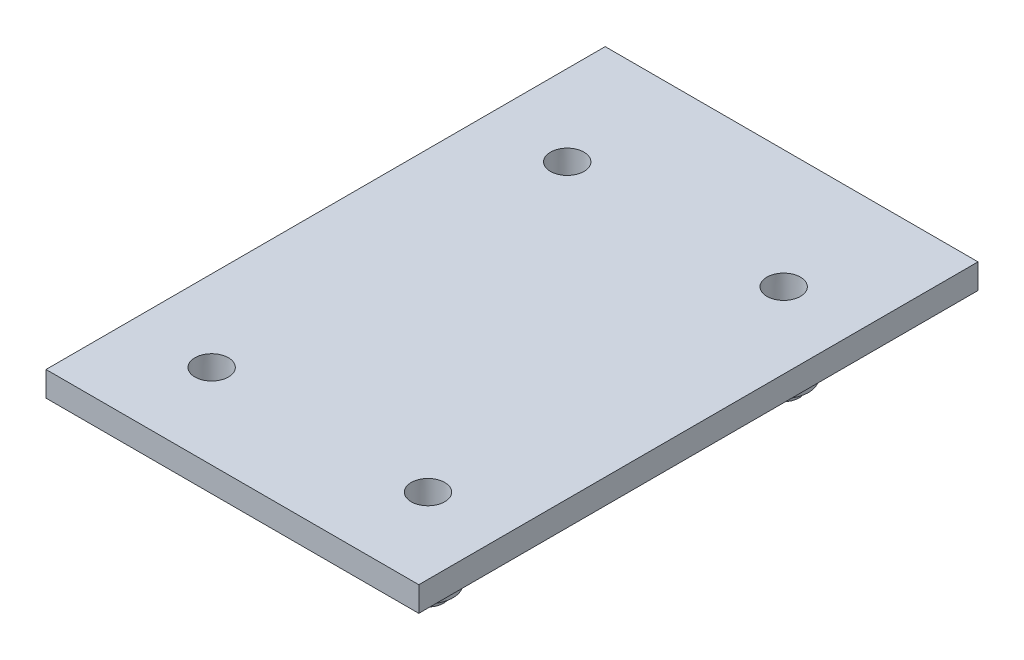
ISO-10303-21;
HEADER;
FILE_DESCRIPTION(('STEP AP214'),'2;1');
FILE_NAME('part.step','',(''),(''),'','','');
FILE_SCHEMA(('AUTOMOTIVE_DESIGN { 1 0 10303 214 1 1 1 1 }'));
ENDSEC;
DATA;
#1=APPLICATION_CONTEXT('core data for automotive mechanical design processes');
#2=APPLICATION_PROTOCOL_DEFINITION('international standard','automotive_design',2000,#1);
#3=PRODUCT_CONTEXT('',#1,'mechanical');
#4=PRODUCT('Part','Part','',(#3));
#5=PRODUCT_RELATED_PRODUCT_CATEGORY('part','',(#4));
#6=PRODUCT_DEFINITION_FORMATION('','',#4);
#7=PRODUCT_DEFINITION_CONTEXT('part definition',#1,'design');
#8=PRODUCT_DEFINITION('design','',#6,#7);
#9=PRODUCT_DEFINITION_SHAPE('','',#8);
#10=(LENGTH_UNIT() NAMED_UNIT(*) SI_UNIT(.MILLI.,.METRE.));
#11=(NAMED_UNIT(*) PLANE_ANGLE_UNIT() SI_UNIT($,.RADIAN.));
#12=(NAMED_UNIT(*) SI_UNIT($,.STERADIAN.) SOLID_ANGLE_UNIT());
#13=UNCERTAINTY_MEASURE_WITH_UNIT(LENGTH_MEASURE(1.E-05),#10,'distance_accuracy_value','');
#14=(GEOMETRIC_REPRESENTATION_CONTEXT(3) GLOBAL_UNCERTAINTY_ASSIGNED_CONTEXT((#13)) GLOBAL_UNIT_ASSIGNED_CONTEXT((#10,
#11,#12)) REPRESENTATION_CONTEXT('',''));
#15=CARTESIAN_POINT('',(0.,0.,0.));
#16=DIRECTION('',(0.,0.,1.));
#17=DIRECTION('',(1.,0.,0.));
#18=AXIS2_PLACEMENT_3D('',#15,#16,#17);
#19=CARTESIAN_POINT('',(30.,4.,45.));
#20=DIRECTION('',(-1.,0.,0.));
#21=DIRECTION('',(0.,0.,1.));
#22=AXIS2_PLACEMENT_3D('',#19,#20,#21);
#23=PLANE('',#22);
#24=DIRECTION('',(0.,0.,-1.));
#25=VECTOR('',#24,1.);
#26=CARTESIAN_POINT('',(30.,0.,45.));
#27=LINE('',#26,#25);
#28=CARTESIAN_POINT('',(30.,0.,45.));
#29=VERTEX_POINT('',#28);
#30=CARTESIAN_POINT('',(30.,0.,-45.));
#31=VERTEX_POINT('',#30);
#32=EDGE_CURVE('E130',#29,#31,#27,.T.);
#33=ORIENTED_EDGE('',*,*,#32,.T.);
#34=DIRECTION('',(0.,-1.,0.));
#35=VECTOR('',#34,1.);
#36=CARTESIAN_POINT('',(30.,4.,-45.));
#37=LINE('',#36,#35);
#38=CARTESIAN_POINT('',(30.,4.,-45.));
#39=VERTEX_POINT('',#38);
#40=EDGE_CURVE('E12',#39,#31,#37,.T.);
#41=ORIENTED_EDGE('',*,*,#40,.F.);
#42=DIRECTION('',(0.,0.,-1.));
#43=VECTOR('',#42,1.);
#44=CARTESIAN_POINT('',(30.,4.,45.));
#45=LINE('',#44,#43);
#46=CARTESIAN_POINT('',(30.,4.,45.));
#47=VERTEX_POINT('',#46);
#48=EDGE_CURVE('E140',#47,#39,#45,.T.);
#49=ORIENTED_EDGE('',*,*,#48,.F.);
#50=DIRECTION('',(0.,-1.,0.));
#51=VECTOR('',#50,1.);
#52=CARTESIAN_POINT('',(30.,4.,45.));
#53=LINE('',#52,#51);
#54=EDGE_CURVE('E149',#47,#29,#53,.T.);
#55=ORIENTED_EDGE('',*,*,#54,.T.);
#56=EDGE_LOOP('',(#33,#41,#49,#55));
#57=FACE_BOUND('',#56,.T.);
#58=ADVANCED_FACE('F44',(#57),#23,.F.);
#59=CARTESIAN_POINT('',(-30.,4.,-45.));
#60=DIRECTION('',(0.,0.,1.));
#61=DIRECTION('',(1.,0.,0.));
#62=AXIS2_PLACEMENT_3D('',#59,#60,#61);
#63=PLANE('',#62);
#64=DIRECTION('',(-1.,0.,0.));
#65=VECTOR('',#64,1.);
#66=CARTESIAN_POINT('',(-30.,0.,-45.));
#67=LINE('',#66,#65);
#68=CARTESIAN_POINT('',(-30.,0.,-45.));
#69=VERTEX_POINT('',#68);
#70=EDGE_CURVE('E132',#31,#69,#67,.T.);
#71=ORIENTED_EDGE('',*,*,#70,.T.);
#72=DIRECTION('',(0.,-1.,0.));
#73=VECTOR('',#72,1.);
#74=CARTESIAN_POINT('',(-30.,4.,-45.));
#75=LINE('',#74,#73);
#76=CARTESIAN_POINT('',(-30.,4.,-45.));
#77=VERTEX_POINT('',#76);
#78=EDGE_CURVE('E52',#77,#69,#75,.T.);
#79=ORIENTED_EDGE('',*,*,#78,.F.);
#80=DIRECTION('',(-1.,0.,0.));
#81=VECTOR('',#80,1.);
#82=CARTESIAN_POINT('',(-30.,4.,-45.));
#83=LINE('',#82,#81);
#84=EDGE_CURVE('E143',#39,#77,#83,.T.);
#85=ORIENTED_EDGE('',*,*,#84,.F.);
#86=ORIENTED_EDGE('',*,*,#40,.T.);
#87=EDGE_LOOP('',(#71,#79,#85,#86));
#88=FACE_BOUND('',#87,.T.);
#89=ADVANCED_FACE('F277',(#88),#63,.F.);
#90=CARTESIAN_POINT('',(-30.,4.,45.));
#91=DIRECTION('',(1.,0.,0.));
#92=DIRECTION('',(0.,0.,-1.));
#93=AXIS2_PLACEMENT_3D('',#90,#91,#92);
#94=PLANE('',#93);
#95=DIRECTION('',(0.,0.,1.));
#96=VECTOR('',#95,1.);
#97=CARTESIAN_POINT('',(-30.,0.,45.));
#98=LINE('',#97,#96);
#99=CARTESIAN_POINT('',(-30.,0.,45.));
#100=VERTEX_POINT('',#99);
#101=EDGE_CURVE('E152',#69,#100,#98,.T.);
#102=ORIENTED_EDGE('',*,*,#101,.T.);
#103=DIRECTION('',(0.,-1.,0.));
#104=VECTOR('',#103,1.);
#105=CARTESIAN_POINT('',(-30.,4.,45.));
#106=LINE('',#105,#104);
#107=CARTESIAN_POINT('',(-30.,4.,45.));
#108=VERTEX_POINT('',#107);
#109=EDGE_CURVE('E157',#108,#100,#106,.T.);
#110=ORIENTED_EDGE('',*,*,#109,.F.);
#111=DIRECTION('',(0.,0.,1.));
#112=VECTOR('',#111,1.);
#113=CARTESIAN_POINT('',(-30.,4.,45.));
#114=LINE('',#113,#112);
#115=EDGE_CURVE('E146',#77,#108,#114,.T.);
#116=ORIENTED_EDGE('',*,*,#115,.F.);
#117=ORIENTED_EDGE('',*,*,#78,.T.);
#118=EDGE_LOOP('',(#102,#110,#116,#117));
#119=FACE_BOUND('',#118,.T.);
#120=ADVANCED_FACE('F282',(#119),#94,.F.);
#121=CARTESIAN_POINT('',(-30.,4.,45.));
#122=DIRECTION('',(0.,0.,-1.));
#123=DIRECTION('',(-1.,0.,0.));
#124=AXIS2_PLACEMENT_3D('',#121,#122,#123);
#125=PLANE('',#124);
#126=DIRECTION('',(1.,0.,0.));
#127=VECTOR('',#126,1.);
#128=CARTESIAN_POINT('',(-30.,0.,45.));
#129=LINE('',#128,#127);
#130=EDGE_CURVE('E144',#100,#29,#129,.T.);
#131=ORIENTED_EDGE('',*,*,#130,.T.);
#132=ORIENTED_EDGE('',*,*,#54,.F.);
#133=DIRECTION('',(1.,0.,0.));
#134=VECTOR('',#133,1.);
#135=CARTESIAN_POINT('',(-30.,4.,45.));
#136=LINE('',#135,#134);
#137=EDGE_CURVE('E148',#108,#47,#136,.T.);
#138=ORIENTED_EDGE('',*,*,#137,.F.);
#139=ORIENTED_EDGE('',*,*,#109,.T.);
#140=EDGE_LOOP('',(#131,#132,#138,#139));
#141=FACE_BOUND('',#140,.T.);
#142=ADVANCED_FACE('F299',(#141),#125,.F.);
#143=CARTESIAN_POINT('',(0.,4.,0.));
#144=DIRECTION('',(0.,-1.,0.));
#145=DIRECTION('',(0.,0.,-1.));
#146=AXIS2_PLACEMENT_3D('',#143,#144,#145);
#147=PLANE('',#146);
#148=CARTESIAN_POINT('',(-17.0018387869124,4.,-25.8889221723884));
#149=DIRECTION('',(0.,-1.,0.));
#150=DIRECTION('',(0.,0.,-1.));
#151=AXIS2_PLACEMENT_3D('',#148,#149,#150);
#152=CIRCLE('',#151,2.69629966018273);
#153=CARTESIAN_POINT('',(-17.0018387869124,4.,-28.5852218325711));
#154=VERTEX_POINT('',#153);
#155=EDGE_CURVE('E47',#154,#154,#152,.T.);
#156=ORIENTED_EDGE('',*,*,#155,.T.);
#157=EDGE_LOOP('',(#156));
#158=FACE_BOUND('',#157,.T.);
#159=CARTESIAN_POINT('',(17.8349114378147,4.,-25.8889221723884));
#160=DIRECTION('',(0.,-1.,0.));
#161=DIRECTION('',(0.,0.,-1.));
#162=AXIS2_PLACEMENT_3D('',#159,#160,#161);
#163=CIRCLE('',#162,2.69629966018273);
#164=CARTESIAN_POINT('',(17.8349114378147,4.,-28.5852218325711));
#165=VERTEX_POINT('',#164);
#166=EDGE_CURVE('E171',#165,#165,#163,.T.);
#167=ORIENTED_EDGE('',*,*,#166,.T.);
#168=EDGE_LOOP('',(#167));
#169=FACE_BOUND('',#168,.T.);
#170=CARTESIAN_POINT('',(17.8349114378147,4.,31.3583092049967));
#171=DIRECTION('',(0.,-1.,0.));
#172=DIRECTION('',(0.,0.,-1.));
#173=AXIS2_PLACEMENT_3D('',#170,#171,#172);
#174=CIRCLE('',#173,2.69629966018273);
#175=CARTESIAN_POINT('',(17.8349114378147,4.,28.662009544814));
#176=VERTEX_POINT('',#175);
#177=EDGE_CURVE('E167',#176,#176,#174,.T.);
#178=ORIENTED_EDGE('',*,*,#177,.T.);
#179=EDGE_LOOP('',(#178));
#180=FACE_BOUND('',#179,.T.);
#181=CARTESIAN_POINT('',(-16.9575770469292,4.,31.3777064335516));
#182=DIRECTION('',(0.,-1.,0.));
#183=DIRECTION('',(0.,0.,-1.));
#184=AXIS2_PLACEMENT_3D('',#181,#182,#183);
#185=CIRCLE('',#184,2.69629966018273);
#186=CARTESIAN_POINT('',(-16.9575770469292,4.,28.6814067733688));
#187=VERTEX_POINT('',#186);
#188=EDGE_CURVE('E162',#187,#187,#185,.T.);
#189=ORIENTED_EDGE('',*,*,#188,.T.);
#190=EDGE_LOOP('',(#189));
#191=FACE_BOUND('',#190,.T.);
#192=ORIENTED_EDGE('',*,*,#48,.T.);
#193=ORIENTED_EDGE('',*,*,#84,.T.);
#194=ORIENTED_EDGE('',*,*,#115,.T.);
#195=ORIENTED_EDGE('',*,*,#137,.T.);
#196=EDGE_LOOP('',(#192,#193,#194,#195));
#197=FACE_BOUND('',#196,.T.);
#198=ADVANCED_FACE('F295',(#158,#169,#180,#191,#197),#147,.F.);
#199=CARTESIAN_POINT('',(0.,0.,0.));
#200=DIRECTION('',(0.,-1.,0.));
#201=DIRECTION('',(0.,0.,-1.));
#202=AXIS2_PLACEMENT_3D('',#199,#200,#201);
#203=PLANE('',#202);
#204=DIRECTION('',(0.,0.,1.));
#205=VECTOR('',#204,1.);
#206=CARTESIAN_POINT('',(27.,0.,-42.));
#207=LINE('',#206,#205);
#208=CARTESIAN_POINT('',(27.,0.,-42.));
#209=VERTEX_POINT('',#208);
#210=CARTESIAN_POINT('',(27.,0.,42.));
#211=VERTEX_POINT('',#210);
#212=EDGE_CURVE('E60',#209,#211,#207,.T.);
#213=ORIENTED_EDGE('',*,*,#212,.F.);
#214=DIRECTION('',(1.,0.,0.));
#215=VECTOR('',#214,1.);
#216=CARTESIAN_POINT('',(-27.,0.,-42.));
#217=LINE('',#216,#215);
#218=CARTESIAN_POINT('',(-27.,0.,-42.));
#219=VERTEX_POINT('',#218);
#220=EDGE_CURVE('E64',#219,#209,#217,.T.);
#221=ORIENTED_EDGE('',*,*,#220,.F.);
#222=DIRECTION('',(0.,0.,-1.));
#223=VECTOR('',#222,1.);
#224=CARTESIAN_POINT('',(-27.,0.,-42.));
#225=LINE('',#224,#223);
#226=CARTESIAN_POINT('',(-27.,0.,42.));
#227=VERTEX_POINT('',#226);
#228=EDGE_CURVE('E252',#227,#219,#225,.T.);
#229=ORIENTED_EDGE('',*,*,#228,.F.);
#230=DIRECTION('',(-1.,0.,0.));
#231=VECTOR('',#230,1.);
#232=CARTESIAN_POINT('',(-27.,0.,42.));
#233=LINE('',#232,#231);
#234=EDGE_CURVE('E249',#211,#227,#233,.T.);
#235=ORIENTED_EDGE('',*,*,#234,.F.);
#236=EDGE_LOOP('',(#213,#221,#229,#235));
#237=FACE_BOUND('',#236,.T.);
#238=ORIENTED_EDGE('',*,*,#32,.F.);
#239=ORIENTED_EDGE('',*,*,#130,.F.);
#240=ORIENTED_EDGE('',*,*,#101,.F.);
#241=ORIENTED_EDGE('',*,*,#70,.F.);
#242=EDGE_LOOP('',(#238,#239,#240,#241));
#243=FACE_BOUND('',#242,.T.);
#244=ADVANCED_FACE('F290',(#237,#243),#203,.T.);
#245=CARTESIAN_POINT('',(27.,-3.,-42.));
#246=DIRECTION('',(-1.,0.,0.));
#247=DIRECTION('',(0.,0.,1.));
#248=AXIS2_PLACEMENT_3D('',#245,#246,#247);
#249=PLANE('',#248);
#250=ORIENTED_EDGE('',*,*,#212,.T.);
#251=DIRECTION('',(0.,1.,0.));
#252=VECTOR('',#251,1.);
#253=CARTESIAN_POINT('',(27.,-3.,42.));
#254=LINE('',#253,#252);
#255=CARTESIAN_POINT('',(27.,-3.,42.));
#256=VERTEX_POINT('',#255);
#257=EDGE_CURVE('E113',#256,#211,#254,.T.);
#258=ORIENTED_EDGE('',*,*,#257,.F.);
#259=DIRECTION('',(0.,0.,1.));
#260=VECTOR('',#259,1.);
#261=CARTESIAN_POINT('',(27.,-3.,-42.));
#262=LINE('',#261,#260);
#263=CARTESIAN_POINT('',(27.,-3.,-42.));
#264=VERTEX_POINT('',#263);
#265=EDGE_CURVE('E119',#264,#256,#262,.T.);
#266=ORIENTED_EDGE('',*,*,#265,.F.);
#267=DIRECTION('',(0.,1.,0.));
#268=VECTOR('',#267,1.);
#269=CARTESIAN_POINT('',(27.,-3.,-42.));
#270=LINE('',#269,#268);
#271=EDGE_CURVE('E247',#264,#209,#270,.T.);
#272=ORIENTED_EDGE('',*,*,#271,.T.);
#273=EDGE_LOOP('',(#250,#258,#266,#272));
#274=FACE_BOUND('',#273,.T.);
#275=ADVANCED_FACE('F129',(#274),#249,.F.);
#276=CARTESIAN_POINT('',(-27.,-3.,42.));
#277=DIRECTION('',(0.,0.,-1.));
#278=DIRECTION('',(-1.,0.,0.));
#279=AXIS2_PLACEMENT_3D('',#276,#277,#278);
#280=PLANE('',#279);
#281=ORIENTED_EDGE('',*,*,#234,.T.);
#282=DIRECTION('',(0.,1.,0.));
#283=VECTOR('',#282,1.);
#284=CARTESIAN_POINT('',(-27.,-3.,42.));
#285=LINE('',#284,#283);
#286=CARTESIAN_POINT('',(-27.,-3.,42.));
#287=VERTEX_POINT('',#286);
#288=EDGE_CURVE('E115',#287,#227,#285,.T.);
#289=ORIENTED_EDGE('',*,*,#288,.F.);
#290=DIRECTION('',(-1.,0.,0.));
#291=VECTOR('',#290,1.);
#292=CARTESIAN_POINT('',(-27.,-3.,42.));
#293=LINE('',#292,#291);
#294=EDGE_CURVE('E108',#256,#287,#293,.T.);
#295=ORIENTED_EDGE('',*,*,#294,.F.);
#296=ORIENTED_EDGE('',*,*,#257,.T.);
#297=EDGE_LOOP('',(#281,#289,#295,#296));
#298=FACE_BOUND('',#297,.T.);
#299=ADVANCED_FACE('F111',(#298),#280,.F.);
#300=CARTESIAN_POINT('',(-27.,-3.,-42.));
#301=DIRECTION('',(1.,0.,0.));
#302=DIRECTION('',(0.,0.,-1.));
#303=AXIS2_PLACEMENT_3D('',#300,#301,#302);
#304=PLANE('',#303);
#305=ORIENTED_EDGE('',*,*,#228,.T.);
#306=DIRECTION('',(0.,1.,0.));
#307=VECTOR('',#306,1.);
#308=CARTESIAN_POINT('',(-27.,-3.,-42.));
#309=LINE('',#308,#307);
#310=CARTESIAN_POINT('',(-27.,-3.,-42.));
#311=VERTEX_POINT('',#310);
#312=EDGE_CURVE('E134',#311,#219,#309,.T.);
#313=ORIENTED_EDGE('',*,*,#312,.F.);
#314=DIRECTION('',(0.,0.,-1.));
#315=VECTOR('',#314,1.);
#316=CARTESIAN_POINT('',(-27.,-3.,-42.));
#317=LINE('',#316,#315);
#318=EDGE_CURVE('E118',#287,#311,#317,.T.);
#319=ORIENTED_EDGE('',*,*,#318,.F.);
#320=ORIENTED_EDGE('',*,*,#288,.T.);
#321=EDGE_LOOP('',(#305,#313,#319,#320));
#322=FACE_BOUND('',#321,.T.);
#323=ADVANCED_FACE('F263',(#322),#304,.F.);
#324=CARTESIAN_POINT('',(-27.,-3.,-42.));
#325=DIRECTION('',(0.,0.,1.));
#326=DIRECTION('',(1.,0.,0.));
#327=AXIS2_PLACEMENT_3D('',#324,#325,#326);
#328=PLANE('',#327);
#329=ORIENTED_EDGE('',*,*,#220,.T.);
#330=ORIENTED_EDGE('',*,*,#271,.F.);
#331=DIRECTION('',(1.,0.,0.));
#332=VECTOR('',#331,1.);
#333=CARTESIAN_POINT('',(-27.,-3.,-42.));
#334=LINE('',#333,#332);
#335=EDGE_CURVE('E124',#311,#264,#334,.T.);
#336=ORIENTED_EDGE('',*,*,#335,.F.);
#337=ORIENTED_EDGE('',*,*,#312,.T.);
#338=EDGE_LOOP('',(#329,#330,#336,#337));
#339=FACE_BOUND('',#338,.T.);
#340=ADVANCED_FACE('F264',(#339),#328,.F.);
#341=CARTESIAN_POINT('',(0.,-3.,0.));
#342=DIRECTION('',(0.,1.,0.));
#343=DIRECTION('',(0.,0.,1.));
#344=AXIS2_PLACEMENT_3D('',#341,#342,#343);
#345=PLANE('',#344);
#346=CARTESIAN_POINT('',(-17.0018387869124,-3.,-25.8889221723884));
#347=DIRECTION('',(0.,1.,0.));
#348=DIRECTION('',(0.,0.,1.));
#349=AXIS2_PLACEMENT_3D('',#346,#347,#348);
#350=CIRCLE('',#349,4.20070541662467);
#351=CARTESIAN_POINT('',(-17.0018387869124,-3.,-21.6882167557637));
#352=VERTEX_POINT('',#351);
#353=EDGE_CURVE('E639',#352,#352,#350,.F.);
#354=ORIENTED_EDGE('',*,*,#353,.F.);
#355=EDGE_LOOP('',(#354));
#356=FACE_BOUND('',#355,.T.);
#357=CARTESIAN_POINT('',(17.8349114378147,-3.,-25.8889221723884));
#358=DIRECTION('',(0.,1.,0.));
#359=DIRECTION('',(0.,0.,1.));
#360=AXIS2_PLACEMENT_3D('',#357,#358,#359);
#361=CIRCLE('',#360,4.20070541662467);
#362=CARTESIAN_POINT('',(17.8349114378147,-3.,-21.6882167557637));
#363=VERTEX_POINT('',#362);
#364=EDGE_CURVE('E195',#363,#363,#361,.F.);
#365=ORIENTED_EDGE('',*,*,#364,.F.);
#366=EDGE_LOOP('',(#365));
#367=FACE_BOUND('',#366,.T.);
#368=CARTESIAN_POINT('',(17.8349114378147,-3.,31.3583092049967));
#369=DIRECTION('',(0.,1.,0.));
#370=DIRECTION('',(0.,0.,1.));
#371=AXIS2_PLACEMENT_3D('',#368,#369,#370);
#372=CIRCLE('',#371,4.20070541662467);
#373=CARTESIAN_POINT('',(17.8349114378147,-3.,35.5590146216214));
#374=VERTEX_POINT('',#373);
#375=EDGE_CURVE('E214',#374,#374,#372,.F.);
#376=ORIENTED_EDGE('',*,*,#375,.F.);
#377=EDGE_LOOP('',(#376));
#378=FACE_BOUND('',#377,.T.);
#379=CARTESIAN_POINT('',(-16.9575770469292,-3.,31.3777064335516));
#380=DIRECTION('',(0.,1.,0.));
#381=DIRECTION('',(0.,0.,1.));
#382=AXIS2_PLACEMENT_3D('',#379,#380,#381);
#383=CIRCLE('',#382,4.20070541662467);
#384=CARTESIAN_POINT('',(-16.9575770469292,-3.,35.5784118501762));
#385=VERTEX_POINT('',#384);
#386=EDGE_CURVE('E233',#385,#385,#383,.F.);
#387=ORIENTED_EDGE('',*,*,#386,.F.);
#388=EDGE_LOOP('',(#387));
#389=FACE_BOUND('',#388,.T.);
#390=ORIENTED_EDGE('',*,*,#265,.T.);
#391=ORIENTED_EDGE('',*,*,#294,.T.);
#392=ORIENTED_EDGE('',*,*,#318,.T.);
#393=ORIENTED_EDGE('',*,*,#335,.T.);
#394=EDGE_LOOP('',(#390,#391,#392,#393));
#395=FACE_BOUND('',#394,.T.);
#396=ADVANCED_FACE('F122',(#356,#367,#378,#389,#395),#345,.F.);
#397=CARTESIAN_POINT('',(-16.9575770469292,-8.74600000000003,31.3777064335516));
#398=DIRECTION('',(0.,1.,0.));
#399=DIRECTION('',(0.948683298050514,0.,-0.316227766016838));
#400=AXIS2_PLACEMENT_3D('',#397,#398,#399);
#401=CONICAL_SURFACE('',#400,4.,0.03491539349594);
#402=CARTESIAN_POINT('',(-16.9575770469292,-8.74600000000003,31.3777064335516));
#403=DIRECTION('',(0.,1.,0.));
#404=DIRECTION('',(0.948683298050514,0.,-0.316227766016838));
#405=AXIS2_PLACEMENT_3D('',#402,#403,#404);
#406=CIRCLE('',#405,4.);
#407=CARTESIAN_POINT('',(-13.1628438547272,-8.74600000000003,30.1127953694842));
#408=VERTEX_POINT('',#407);
#409=EDGE_CURVE('E227',#408,#408,#406,.T.);
#410=ORIENTED_EDGE('',*,*,#409,.T.);
#411=EDGE_LOOP('',(#410));
#412=FACE_BOUND('',#411,.T.);
#413=ORIENTED_EDGE('',*,*,#386,.T.);
#414=EDGE_LOOP('',(#413));
#415=FACE_BOUND('',#414,.T.);
#416=ADVANCED_FACE('F272',(#412,#415),#401,.T.);
#417=CARTESIAN_POINT('',(-16.9575770469292,-8.74600000000003,31.3777064335516));
#418=DIRECTION('',(0.,-1.,0.));
#419=DIRECTION('',(-0.948683298050514,0.,0.316227766016838));
#420=AXIS2_PLACEMENT_3D('',#417,#418,#419);
#421=PLANE('',#420);
#422=CARTESIAN_POINT('',(-16.9575770469292,-8.74600000000003,31.3777064335516));
#423=DIRECTION('',(0.,-1.,0.));
#424=DIRECTION('',(-0.948683298050514,0.,0.316227766016838));
#425=AXIS2_PLACEMENT_3D('',#422,#423,#424);
#426=CIRCLE('',#425,2.55238115423762);
#427=CARTESIAN_POINT('',(-19.3789784182134,-8.74600000000003,32.1848402239796));
#428=VERTEX_POINT('',#427);
#429=EDGE_CURVE('E230',#428,#428,#426,.T.);
#430=ORIENTED_EDGE('',*,*,#429,.F.);
#431=EDGE_LOOP('',(#430));
#432=FACE_BOUND('',#431,.T.);
#433=ORIENTED_EDGE('',*,*,#409,.F.);
#434=EDGE_LOOP('',(#433));
#435=FACE_BOUND('',#434,.T.);
#436=ADVANCED_FACE('F338',(#432,#435),#421,.T.);
#437=CARTESIAN_POINT('',(-16.9575770469292,-10.246,31.3777064335516));
#438=DIRECTION('',(0.,-1.,0.));
#439=DIRECTION('',(-0.948683298050514,0.,0.316227766016838));
#440=AXIS2_PLACEMENT_3D('',#437,#438,#439);
#441=PLANE('',#440);
#442=CARTESIAN_POINT('',(-16.9575770469292,-10.246,31.3777064335516));
#443=DIRECTION('',(0.,1.,0.));
#444=DIRECTION('',(0.948683298050514,0.,-0.316227766016838));
#445=AXIS2_PLACEMENT_3D('',#442,#443,#444);
#446=CIRCLE('',#445,1.6);
#447=CARTESIAN_POINT('',(-15.4396837700484,-10.246,30.8717420079246));
#448=VERTEX_POINT('',#447);
#449=EDGE_CURVE('E217',#448,#448,#446,.T.);
#450=ORIENTED_EDGE('',*,*,#449,.T.);
#451=EDGE_LOOP('',(#450));
#452=FACE_BOUND('',#451,.T.);
#453=CARTESIAN_POINT('',(-16.9575770469292,-10.246,31.3777064335516));
#454=DIRECTION('',(0.,1.,0.));
#455=DIRECTION('',(0.948683298050514,0.,-0.316227766016838));
#456=AXIS2_PLACEMENT_3D('',#453,#454,#455);
#457=CIRCLE('',#456,2.5);
#458=CARTESIAN_POINT('',(-14.585868801803,-10.246,30.5871370185095));
#459=VERTEX_POINT('',#458);
#460=EDGE_CURVE('E165',#459,#459,#457,.T.);
#461=ORIENTED_EDGE('',*,*,#460,.F.);
#462=EDGE_LOOP('',(#461));
#463=FACE_BOUND('',#462,.T.);
#464=ADVANCED_FACE('F348',(#452,#463),#441,.T.);
#465=CARTESIAN_POINT('',(-16.9575770469292,-10.246,31.3777064335516));
#466=DIRECTION('',(0.,1.,0.));
#467=DIRECTION('',(0.948683298050514,0.,-0.316227766016838));
#468=AXIS2_PLACEMENT_3D('',#465,#466,#467);
#469=CONICAL_SURFACE('',#468,2.5,0.0349065850398883);
#470=ORIENTED_EDGE('',*,*,#429,.T.);
#471=EDGE_LOOP('',(#470));
#472=FACE_BOUND('',#471,.T.);
#473=ORIENTED_EDGE('',*,*,#460,.T.);
#474=EDGE_LOOP('',(#473));
#475=FACE_BOUND('',#474,.T.);
#476=ADVANCED_FACE('F358',(#472,#475),#469,.T.);
#477=CARTESIAN_POINT('',(-16.9575770469292,-7.246,31.3777064335516));
#478=DIRECTION('',(0.,1.,0.));
#479=DIRECTION('',(0.948683298050514,0.,-0.316227766016838));
#480=AXIS2_PLACEMENT_3D('',#477,#478,#479);
#481=CONICAL_SURFACE('',#480,2.5,0.0174532925199433);
#482=CARTESIAN_POINT('',(-16.9575770469292,-7.246,31.3777064335516));
#483=DIRECTION('',(0.,1.,0.));
#484=DIRECTION('',(0.948683298050514,0.,-0.316227766016838));
#485=AXIS2_PLACEMENT_3D('',#482,#483,#484);
#486=CIRCLE('',#485,2.5);
#487=CARTESIAN_POINT('',(-14.585868801803,-7.246,30.5871370185095));
#488=VERTEX_POINT('',#487);
#489=EDGE_CURVE('E220',#488,#488,#486,.T.);
#490=ORIENTED_EDGE('',*,*,#489,.F.);
#491=EDGE_LOOP('',(#490));
#492=FACE_BOUND('',#491,.T.);
#493=ORIENTED_EDGE('',*,*,#188,.F.);
#494=EDGE_LOOP('',(#493));
#495=FACE_BOUND('',#494,.T.);
#496=ADVANCED_FACE('F368',(#492,#495),#481,.F.);
#497=CARTESIAN_POINT('',(-16.9575770469292,-7.246,31.3777064335516));
#498=DIRECTION('',(0.,-1.,0.));
#499=DIRECTION('',(-0.948683298050514,0.,0.316227766016838));
#500=AXIS2_PLACEMENT_3D('',#497,#498,#499);
#501=PLANE('',#500);
#502=CARTESIAN_POINT('',(-16.9575770469292,-7.246,31.3777064335516));
#503=DIRECTION('',(0.,-1.,0.));
#504=DIRECTION('',(-0.948683298050514,0.,0.316227766016838));
#505=AXIS2_PLACEMENT_3D('',#502,#503,#504);
#506=CIRCLE('',#505,1.6);
#507=CARTESIAN_POINT('',(-18.4754703238101,-7.246,31.8836708591785));
#508=VERTEX_POINT('',#507);
#509=EDGE_CURVE('E166',#508,#508,#506,.T.);
#510=ORIENTED_EDGE('',*,*,#509,.T.);
#511=EDGE_LOOP('',(#510));
#512=FACE_BOUND('',#511,.T.);
#513=ORIENTED_EDGE('',*,*,#489,.T.);
#514=EDGE_LOOP('',(#513));
#515=FACE_BOUND('',#514,.T.);
#516=ADVANCED_FACE('F378',(#512,#515),#501,.F.);
#517=CARTESIAN_POINT('',(-16.9575770469292,-10.246,31.3777064335516));
#518=DIRECTION('',(0.,1.,0.));
#519=DIRECTION('',(0.948683298050514,0.,-0.316227766016838));
#520=AXIS2_PLACEMENT_3D('',#517,#518,#519);
#521=CYLINDRICAL_SURFACE('',#520,1.6);
#522=ORIENTED_EDGE('',*,*,#509,.F.);
#523=EDGE_LOOP('',(#522));
#524=FACE_BOUND('',#523,.T.);
#525=ORIENTED_EDGE('',*,*,#449,.F.);
#526=EDGE_LOOP('',(#525));
#527=FACE_BOUND('',#526,.T.);
#528=ADVANCED_FACE('F388',(#524,#527),#521,.F.);
#529=CARTESIAN_POINT('',(17.8349114378147,-8.74600000000003,31.3583092049967));
#530=DIRECTION('',(0.,1.,0.));
#531=DIRECTION('',(0.948683298050514,0.,-0.316227766016838));
#532=AXIS2_PLACEMENT_3D('',#529,#530,#531);
#533=CONICAL_SURFACE('',#532,4.,0.03491539349594);
#534=CARTESIAN_POINT('',(17.8349114378147,-8.74600000000003,31.3583092049967));
#535=DIRECTION('',(0.,1.,0.));
#536=DIRECTION('',(0.948683298050514,0.,-0.316227766016838));
#537=AXIS2_PLACEMENT_3D('',#534,#535,#536);
#538=CIRCLE('',#537,4.);
#539=CARTESIAN_POINT('',(21.6296446300167,-8.74600000000003,30.0933981409294));
#540=VERTEX_POINT('',#539);
#541=EDGE_CURVE('E208',#540,#540,#538,.T.);
#542=ORIENTED_EDGE('',*,*,#541,.T.);
#543=EDGE_LOOP('',(#542));
#544=FACE_BOUND('',#543,.T.);
#545=ORIENTED_EDGE('',*,*,#375,.T.);
#546=EDGE_LOOP('',(#545));
#547=FACE_BOUND('',#546,.T.);
#548=ADVANCED_FACE('F398',(#544,#547),#533,.T.);
#549=CARTESIAN_POINT('',(17.8349114378147,-8.74600000000003,31.3583092049967));
#550=DIRECTION('',(0.,-1.,0.));
#551=DIRECTION('',(-0.948683298050514,0.,0.316227766016838));
#552=AXIS2_PLACEMENT_3D('',#549,#550,#551);
#553=PLANE('',#552);
#554=CARTESIAN_POINT('',(17.8349114378147,-8.74600000000003,31.3583092049967));
#555=DIRECTION('',(0.,-1.,0.));
#556=DIRECTION('',(-0.948683298050514,0.,0.316227766016838));
#557=AXIS2_PLACEMENT_3D('',#554,#555,#556);
#558=CIRCLE('',#557,2.55238115423762);
#559=CARTESIAN_POINT('',(15.4135100665306,-8.74600000000003,32.1654429954248));
#560=VERTEX_POINT('',#559);
#561=EDGE_CURVE('E211',#560,#560,#558,.T.);
#562=ORIENTED_EDGE('',*,*,#561,.F.);
#563=EDGE_LOOP('',(#562));
#564=FACE_BOUND('',#563,.T.);
#565=ORIENTED_EDGE('',*,*,#541,.F.);
#566=EDGE_LOOP('',(#565));
#567=FACE_BOUND('',#566,.T.);
#568=ADVANCED_FACE('F408',(#564,#567),#553,.T.);
#569=CARTESIAN_POINT('',(17.8349114378147,-10.246,31.3583092049967));
#570=DIRECTION('',(0.,-1.,0.));
#571=DIRECTION('',(-0.948683298050514,0.,0.316227766016838));
#572=AXIS2_PLACEMENT_3D('',#569,#570,#571);
#573=PLANE('',#572);
#574=CARTESIAN_POINT('',(17.8349114378147,-10.246,31.3583092049967));
#575=DIRECTION('',(0.,1.,0.));
#576=DIRECTION('',(0.948683298050514,0.,-0.316227766016838));
#577=AXIS2_PLACEMENT_3D('',#574,#575,#576);
#578=CIRCLE('',#577,1.6);
#579=CARTESIAN_POINT('',(19.3528047146955,-10.246,30.8523447793698));
#580=VERTEX_POINT('',#579);
#581=EDGE_CURVE('E198',#580,#580,#578,.T.);
#582=ORIENTED_EDGE('',*,*,#581,.T.);
#583=EDGE_LOOP('',(#582));
#584=FACE_BOUND('',#583,.T.);
#585=CARTESIAN_POINT('',(17.8349114378147,-10.246,31.3583092049967));
#586=DIRECTION('',(0.,1.,0.));
#587=DIRECTION('',(0.948683298050514,0.,-0.316227766016838));
#588=AXIS2_PLACEMENT_3D('',#585,#586,#587);
#589=CIRCLE('',#588,2.5);
#590=CARTESIAN_POINT('',(20.206619682941,-10.246,30.5677397899546));
#591=VERTEX_POINT('',#590);
#592=EDGE_CURVE('E169',#591,#591,#589,.T.);
#593=ORIENTED_EDGE('',*,*,#592,.F.);
#594=EDGE_LOOP('',(#593));
#595=FACE_BOUND('',#594,.T.);
#596=ADVANCED_FACE('F418',(#584,#595),#573,.T.);
#597=CARTESIAN_POINT('',(17.8349114378147,-10.246,31.3583092049967));
#598=DIRECTION('',(0.,1.,0.));
#599=DIRECTION('',(0.948683298050514,0.,-0.316227766016838));
#600=AXIS2_PLACEMENT_3D('',#597,#598,#599);
#601=CONICAL_SURFACE('',#600,2.5,0.0349065850398883);
#602=ORIENTED_EDGE('',*,*,#561,.T.);
#603=EDGE_LOOP('',(#602));
#604=FACE_BOUND('',#603,.T.);
#605=ORIENTED_EDGE('',*,*,#592,.T.);
#606=EDGE_LOOP('',(#605));
#607=FACE_BOUND('',#606,.T.);
#608=ADVANCED_FACE('F428',(#604,#607),#601,.T.);
#609=CARTESIAN_POINT('',(17.8349114378147,-7.246,31.3583092049967));
#610=DIRECTION('',(0.,1.,0.));
#611=DIRECTION('',(0.948683298050514,0.,-0.316227766016838));
#612=AXIS2_PLACEMENT_3D('',#609,#610,#611);
#613=CONICAL_SURFACE('',#612,2.5,0.0174532925199433);
#614=CARTESIAN_POINT('',(17.8349114378147,-7.246,31.3583092049967));
#615=DIRECTION('',(0.,1.,0.));
#616=DIRECTION('',(0.948683298050514,0.,-0.316227766016838));
#617=AXIS2_PLACEMENT_3D('',#614,#615,#616);
#618=CIRCLE('',#617,2.5);
#619=CARTESIAN_POINT('',(20.206619682941,-7.246,30.5677397899546));
#620=VERTEX_POINT('',#619);
#621=EDGE_CURVE('E201',#620,#620,#618,.T.);
#622=ORIENTED_EDGE('',*,*,#621,.F.);
#623=EDGE_LOOP('',(#622));
#624=FACE_BOUND('',#623,.T.);
#625=ORIENTED_EDGE('',*,*,#177,.F.);
#626=EDGE_LOOP('',(#625));
#627=FACE_BOUND('',#626,.T.);
#628=ADVANCED_FACE('F438',(#624,#627),#613,.F.);
#629=CARTESIAN_POINT('',(17.8349114378147,-7.246,31.3583092049967));
#630=DIRECTION('',(0.,-1.,0.));
#631=DIRECTION('',(-0.948683298050514,0.,0.316227766016838));
#632=AXIS2_PLACEMENT_3D('',#629,#630,#631);
#633=PLANE('',#632);
#634=CARTESIAN_POINT('',(17.8349114378147,-7.246,31.3583092049967));
#635=DIRECTION('',(0.,-1.,0.));
#636=DIRECTION('',(-0.948683298050514,0.,0.316227766016838));
#637=AXIS2_PLACEMENT_3D('',#634,#635,#636);
#638=CIRCLE('',#637,1.6);
#639=CARTESIAN_POINT('',(16.3170181609339,-7.246,31.8642736306237));
#640=VERTEX_POINT('',#639);
#641=EDGE_CURVE('E170',#640,#640,#638,.T.);
#642=ORIENTED_EDGE('',*,*,#641,.T.);
#643=EDGE_LOOP('',(#642));
#644=FACE_BOUND('',#643,.T.);
#645=ORIENTED_EDGE('',*,*,#621,.T.);
#646=EDGE_LOOP('',(#645));
#647=FACE_BOUND('',#646,.T.);
#648=ADVANCED_FACE('F448',(#644,#647),#633,.F.);
#649=CARTESIAN_POINT('',(17.8349114378147,-10.246,31.3583092049967));
#650=DIRECTION('',(0.,1.,0.));
#651=DIRECTION('',(0.948683298050514,0.,-0.316227766016838));
#652=AXIS2_PLACEMENT_3D('',#649,#650,#651);
#653=CYLINDRICAL_SURFACE('',#652,1.6);
#654=ORIENTED_EDGE('',*,*,#641,.F.);
#655=EDGE_LOOP('',(#654));
#656=FACE_BOUND('',#655,.T.);
#657=ORIENTED_EDGE('',*,*,#581,.F.);
#658=EDGE_LOOP('',(#657));
#659=FACE_BOUND('',#658,.T.);
#660=ADVANCED_FACE('F458',(#656,#659),#653,.F.);
#661=CARTESIAN_POINT('',(17.8349114378147,-8.74600000000003,-25.8889221723884));
#662=DIRECTION('',(0.,1.,0.));
#663=DIRECTION('',(0.948683298050514,0.,-0.316227766016838));
#664=AXIS2_PLACEMENT_3D('',#661,#662,#663);
#665=CONICAL_SURFACE('',#664,4.,0.03491539349594);
#666=CARTESIAN_POINT('',(17.8349114378147,-8.74600000000003,-25.8889221723884));
#667=DIRECTION('',(0.,1.,0.));
#668=DIRECTION('',(0.948683298050514,0.,-0.316227766016838));
#669=AXIS2_PLACEMENT_3D('',#666,#667,#668);
#670=CIRCLE('',#669,4.);
#671=CARTESIAN_POINT('',(21.6296446300167,-8.74600000000003,-27.1538332364557));
#672=VERTEX_POINT('',#671);
#673=EDGE_CURVE('E178',#672,#672,#670,.T.);
#674=ORIENTED_EDGE('',*,*,#673,.T.);
#675=EDGE_LOOP('',(#674));
#676=FACE_BOUND('',#675,.T.);
#677=ORIENTED_EDGE('',*,*,#364,.T.);
#678=EDGE_LOOP('',(#677));
#679=FACE_BOUND('',#678,.T.);
#680=ADVANCED_FACE('F468',(#676,#679),#665,.T.);
#681=CARTESIAN_POINT('',(17.8349114378147,-8.74600000000003,-25.8889221723884));
#682=DIRECTION('',(0.,-1.,0.));
#683=DIRECTION('',(-0.948683298050514,0.,0.316227766016838));
#684=AXIS2_PLACEMENT_3D('',#681,#682,#683);
#685=PLANE('',#684);
#686=CARTESIAN_POINT('',(17.8349114378147,-8.74600000000003,-25.8889221723884));
#687=DIRECTION('',(0.,-1.,0.));
#688=DIRECTION('',(-0.948683298050514,0.,0.316227766016838));
#689=AXIS2_PLACEMENT_3D('',#686,#687,#688);
#690=CIRCLE('',#689,2.55238115423762);
#691=CARTESIAN_POINT('',(15.4135100665306,-8.74600000000003,-25.0817883819603));
#692=VERTEX_POINT('',#691);
#693=EDGE_CURVE('E192',#692,#692,#690,.T.);
#694=ORIENTED_EDGE('',*,*,#693,.F.);
#695=EDGE_LOOP('',(#694));
#696=FACE_BOUND('',#695,.T.);
#697=ORIENTED_EDGE('',*,*,#673,.F.);
#698=EDGE_LOOP('',(#697));
#699=FACE_BOUND('',#698,.T.);
#700=ADVANCED_FACE('F478',(#696,#699),#685,.T.);
#701=CARTESIAN_POINT('',(17.8349114378147,-10.246,-25.8889221723884));
#702=DIRECTION('',(0.,-1.,0.));
#703=DIRECTION('',(-0.948683298050514,0.,0.316227766016838));
#704=AXIS2_PLACEMENT_3D('',#701,#702,#703);
#705=PLANE('',#704);
#706=CARTESIAN_POINT('',(17.8349114378147,-10.246,-25.8889221723884));
#707=DIRECTION('',(0.,1.,0.));
#708=DIRECTION('',(0.948683298050514,0.,-0.316227766016838));
#709=AXIS2_PLACEMENT_3D('',#706,#707,#708);
#710=CIRCLE('',#709,1.6);
#711=CARTESIAN_POINT('',(19.3528047146955,-10.246,-26.3948865980153));
#712=VERTEX_POINT('',#711);
#713=EDGE_CURVE('E186',#712,#712,#710,.T.);
#714=ORIENTED_EDGE('',*,*,#713,.T.);
#715=EDGE_LOOP('',(#714));
#716=FACE_BOUND('',#715,.T.);
#717=CARTESIAN_POINT('',(17.8349114378147,-10.246,-25.8889221723884));
#718=DIRECTION('',(0.,1.,0.));
#719=DIRECTION('',(0.948683298050514,0.,-0.316227766016838));
#720=AXIS2_PLACEMENT_3D('',#717,#718,#719);
#721=CIRCLE('',#720,2.5);
#722=CARTESIAN_POINT('',(20.206619682941,-10.246,-26.6794915874305));
#723=VERTEX_POINT('',#722);
#724=EDGE_CURVE('E173',#723,#723,#721,.T.);
#725=ORIENTED_EDGE('',*,*,#724,.F.);
#726=EDGE_LOOP('',(#725));
#727=FACE_BOUND('',#726,.T.);
#728=ADVANCED_FACE('F488',(#716,#727),#705,.T.);
#729=CARTESIAN_POINT('',(17.8349114378147,-10.246,-25.8889221723884));
#730=DIRECTION('',(0.,1.,0.));
#731=DIRECTION('',(0.948683298050514,0.,-0.316227766016838));
#732=AXIS2_PLACEMENT_3D('',#729,#730,#731);
#733=CONICAL_SURFACE('',#732,2.5,0.0349065850398883);
#734=ORIENTED_EDGE('',*,*,#693,.T.);
#735=EDGE_LOOP('',(#734));
#736=FACE_BOUND('',#735,.T.);
#737=ORIENTED_EDGE('',*,*,#724,.T.);
#738=EDGE_LOOP('',(#737));
#739=FACE_BOUND('',#738,.T.);
#740=ADVANCED_FACE('F498',(#736,#739),#733,.T.);
#741=CARTESIAN_POINT('',(17.8349114378147,-7.246,-25.8889221723884));
#742=DIRECTION('',(0.,1.,0.));
#743=DIRECTION('',(0.948683298050514,0.,-0.316227766016838));
#744=AXIS2_PLACEMENT_3D('',#741,#742,#743);
#745=CONICAL_SURFACE('',#744,2.5,0.0174532925199433);
#746=CARTESIAN_POINT('',(17.8349114378147,-7.246,-25.8889221723884));
#747=DIRECTION('',(0.,1.,0.));
#748=DIRECTION('',(0.948683298050514,0.,-0.316227766016838));
#749=AXIS2_PLACEMENT_3D('',#746,#747,#748);
#750=CIRCLE('',#749,2.5);
#751=CARTESIAN_POINT('',(20.206619682941,-7.246,-26.6794915874305));
#752=VERTEX_POINT('',#751);
#753=EDGE_CURVE('E181',#752,#752,#750,.T.);
#754=ORIENTED_EDGE('',*,*,#753,.F.);
#755=EDGE_LOOP('',(#754));
#756=FACE_BOUND('',#755,.T.);
#757=ORIENTED_EDGE('',*,*,#166,.F.);
#758=EDGE_LOOP('',(#757));
#759=FACE_BOUND('',#758,.T.);
#760=ADVANCED_FACE('F508',(#756,#759),#745,.F.);
#761=CARTESIAN_POINT('',(17.8349114378147,-7.246,-25.8889221723884));
#762=DIRECTION('',(0.,-1.,0.));
#763=DIRECTION('',(-0.948683298050514,0.,0.316227766016838));
#764=AXIS2_PLACEMENT_3D('',#761,#762,#763);
#765=PLANE('',#764);
#766=CARTESIAN_POINT('',(17.8349114378147,-7.246,-25.8889221723884));
#767=DIRECTION('',(0.,-1.,0.));
#768=DIRECTION('',(-0.948683298050514,0.,0.316227766016838));
#769=AXIS2_PLACEMENT_3D('',#766,#767,#768);
#770=CIRCLE('',#769,1.6);
#771=CARTESIAN_POINT('',(16.3170181609339,-7.246,-25.3829577467614));
#772=VERTEX_POINT('',#771);
#773=EDGE_CURVE('E174',#772,#772,#770,.T.);
#774=ORIENTED_EDGE('',*,*,#773,.T.);
#775=EDGE_LOOP('',(#774));
#776=FACE_BOUND('',#775,.T.);
#777=ORIENTED_EDGE('',*,*,#753,.T.);
#778=EDGE_LOOP('',(#777));
#779=FACE_BOUND('',#778,.T.);
#780=ADVANCED_FACE('F518',(#776,#779),#765,.F.);
#781=CARTESIAN_POINT('',(17.8349114378147,-10.246,-25.8889221723884));
#782=DIRECTION('',(0.,1.,0.));
#783=DIRECTION('',(0.948683298050514,0.,-0.316227766016838));
#784=AXIS2_PLACEMENT_3D('',#781,#782,#783);
#785=CYLINDRICAL_SURFACE('',#784,1.6);
#786=ORIENTED_EDGE('',*,*,#773,.F.);
#787=EDGE_LOOP('',(#786));
#788=FACE_BOUND('',#787,.T.);
#789=ORIENTED_EDGE('',*,*,#713,.F.);
#790=EDGE_LOOP('',(#789));
#791=FACE_BOUND('',#790,.T.);
#792=ADVANCED_FACE('F528',(#788,#791),#785,.F.);
#793=CARTESIAN_POINT('',(-17.0018387869124,-8.74600000000003,-25.8889221723884));
#794=DIRECTION('',(0.,1.,0.));
#795=DIRECTION('',(0.948683298050514,0.,-0.316227766016838));
#796=AXIS2_PLACEMENT_3D('',#793,#794,#795);
#797=CONICAL_SURFACE('',#796,4.,0.03491539349594);
#798=CARTESIAN_POINT('',(-17.0018387869124,-8.74600000000003,-25.8889221723884));
#799=DIRECTION('',(0.,1.,0.));
#800=DIRECTION('',(0.948683298050514,0.,-0.316227766016838));
#801=AXIS2_PLACEMENT_3D('',#798,#799,#800);
#802=CIRCLE('',#801,4.);
#803=CARTESIAN_POINT('',(-13.2071055947104,-8.74600000000003,-27.1538332364557));
#804=VERTEX_POINT('',#803);
#805=EDGE_CURVE('E633',#804,#804,#802,.T.);
#806=ORIENTED_EDGE('',*,*,#805,.T.);
#807=EDGE_LOOP('',(#806));
#808=FACE_BOUND('',#807,.T.);
#809=ORIENTED_EDGE('',*,*,#353,.T.);
#810=EDGE_LOOP('',(#809));
#811=FACE_BOUND('',#810,.T.);
#812=ADVANCED_FACE('F536',(#808,#811),#797,.T.);
#813=CARTESIAN_POINT('',(-17.0018387869124,-8.74600000000003,-25.8889221723884));
#814=DIRECTION('',(0.,-1.,0.));
#815=DIRECTION('',(-0.948683298050514,0.,0.316227766016838));
#816=AXIS2_PLACEMENT_3D('',#813,#814,#815);
#817=PLANE('',#816);
#818=CARTESIAN_POINT('',(-17.0018387869124,-8.74600000000003,-25.8889221723884));
#819=DIRECTION('',(0.,-1.,0.));
#820=DIRECTION('',(-0.948683298050514,0.,0.316227766016838));
#821=AXIS2_PLACEMENT_3D('',#818,#819,#820);
#822=CIRCLE('',#821,2.55238115423762);
#823=CARTESIAN_POINT('',(-19.4232401581965,-8.74600000000003,-25.0817883819603));
#824=VERTEX_POINT('',#823);
#825=EDGE_CURVE('E636',#824,#824,#822,.T.);
#826=ORIENTED_EDGE('',*,*,#825,.F.);
#827=EDGE_LOOP('',(#826));
#828=FACE_BOUND('',#827,.T.);
#829=ORIENTED_EDGE('',*,*,#805,.F.);
#830=EDGE_LOOP('',(#829));
#831=FACE_BOUND('',#830,.T.);
#832=ADVANCED_FACE('F553',(#828,#831),#817,.T.);
#833=CARTESIAN_POINT('',(-17.0018387869124,-10.246,-25.8889221723884));
#834=DIRECTION('',(0.,-1.,0.));
#835=DIRECTION('',(-0.948683298050514,0.,0.316227766016838));
#836=AXIS2_PLACEMENT_3D('',#833,#834,#835);
#837=PLANE('',#836);
#838=CARTESIAN_POINT('',(-17.0018387869124,-10.246,-25.8889221723884));
#839=DIRECTION('',(0.,1.,0.));
#840=DIRECTION('',(0.948683298050514,0.,-0.316227766016838));
#841=AXIS2_PLACEMENT_3D('',#838,#839,#840);
#842=CIRCLE('',#841,1.6);
#843=CARTESIAN_POINT('',(-15.4839455100316,-10.246,-26.3948865980153));
#844=VERTEX_POINT('',#843);
#845=EDGE_CURVE('E623',#844,#844,#842,.T.);
#846=ORIENTED_EDGE('',*,*,#845,.T.);
#847=EDGE_LOOP('',(#846));
#848=FACE_BOUND('',#847,.T.);
#849=CARTESIAN_POINT('',(-17.0018387869124,-10.246,-25.8889221723884));
#850=DIRECTION('',(0.,1.,0.));
#851=DIRECTION('',(0.948683298050514,0.,-0.316227766016838));
#852=AXIS2_PLACEMENT_3D('',#849,#850,#851);
#853=CIRCLE('',#852,2.5);
#854=CARTESIAN_POINT('',(-14.6301305417861,-10.246,-26.6794915874305));
#855=VERTEX_POINT('',#854);
#856=EDGE_CURVE('E630',#855,#855,#853,.T.);
#857=ORIENTED_EDGE('',*,*,#856,.F.);
#858=EDGE_LOOP('',(#857));
#859=FACE_BOUND('',#858,.T.);
#860=ADVANCED_FACE('F563',(#848,#859),#837,.T.);
#861=CARTESIAN_POINT('',(-17.0018387869124,-10.246,-25.8889221723884));
#862=DIRECTION('',(0.,1.,0.));
#863=DIRECTION('',(0.948683298050514,0.,-0.316227766016838));
#864=AXIS2_PLACEMENT_3D('',#861,#862,#863);
#865=CONICAL_SURFACE('',#864,2.5,0.0349065850398883);
#866=ORIENTED_EDGE('',*,*,#825,.T.);
#867=EDGE_LOOP('',(#866));
#868=FACE_BOUND('',#867,.T.);
#869=ORIENTED_EDGE('',*,*,#856,.T.);
#870=EDGE_LOOP('',(#869));
#871=FACE_BOUND('',#870,.T.);
#872=ADVANCED_FACE('F573',(#868,#871),#865,.T.);
#873=CARTESIAN_POINT('',(-17.0018387869124,-7.246,-25.8889221723884));
#874=DIRECTION('',(0.,1.,0.));
#875=DIRECTION('',(0.948683298050514,0.,-0.316227766016838));
#876=AXIS2_PLACEMENT_3D('',#873,#874,#875);
#877=CONICAL_SURFACE('',#876,2.5,0.0174532925199433);
#878=CARTESIAN_POINT('',(-17.0018387869124,-7.246,-25.8889221723884));
#879=DIRECTION('',(0.,1.,0.));
#880=DIRECTION('',(0.948683298050514,0.,-0.316227766016838));
#881=AXIS2_PLACEMENT_3D('',#878,#879,#880);
#882=CIRCLE('',#881,2.5);
#883=CARTESIAN_POINT('',(-14.6301305417861,-7.246,-26.6794915874305));
#884=VERTEX_POINT('',#883);
#885=EDGE_CURVE('E624',#884,#884,#882,.T.);
#886=ORIENTED_EDGE('',*,*,#885,.F.);
#887=EDGE_LOOP('',(#886));
#888=FACE_BOUND('',#887,.T.);
#889=ORIENTED_EDGE('',*,*,#155,.F.);
#890=EDGE_LOOP('',(#889));
#891=FACE_BOUND('',#890,.T.);
#892=ADVANCED_FACE('F583',(#888,#891),#877,.F.);
#893=CARTESIAN_POINT('',(-17.0018387869124,-7.246,-25.8889221723884));
#894=DIRECTION('',(0.,-1.,0.));
#895=DIRECTION('',(-0.948683298050514,0.,0.316227766016838));
#896=AXIS2_PLACEMENT_3D('',#893,#894,#895);
#897=PLANE('',#896);
#898=CARTESIAN_POINT('',(-17.0018387869124,-7.246,-25.8889221723884));
#899=DIRECTION('',(0.,-1.,0.));
#900=DIRECTION('',(-0.948683298050514,0.,0.316227766016838));
#901=AXIS2_PLACEMENT_3D('',#898,#899,#900);
#902=CIRCLE('',#901,1.6);
#903=CARTESIAN_POINT('',(-18.5197320637932,-7.246,-25.3829577467614));
#904=VERTEX_POINT('',#903);
#905=EDGE_CURVE('E620',#904,#904,#902,.T.);
#906=ORIENTED_EDGE('',*,*,#905,.T.);
#907=EDGE_LOOP('',(#906));
#908=FACE_BOUND('',#907,.T.);
#909=ORIENTED_EDGE('',*,*,#885,.T.);
#910=EDGE_LOOP('',(#909));
#911=FACE_BOUND('',#910,.T.);
#912=ADVANCED_FACE('F593',(#908,#911),#897,.F.);
#913=CARTESIAN_POINT('',(-17.0018387869124,-10.246,-25.8889221723884));
#914=DIRECTION('',(0.,1.,0.));
#915=DIRECTION('',(0.948683298050514,0.,-0.316227766016838));
#916=AXIS2_PLACEMENT_3D('',#913,#914,#915);
#917=CYLINDRICAL_SURFACE('',#916,1.6);
#918=ORIENTED_EDGE('',*,*,#905,.F.);
#919=EDGE_LOOP('',(#918));
#920=FACE_BOUND('',#919,.T.);
#921=ORIENTED_EDGE('',*,*,#845,.F.);
#922=EDGE_LOOP('',(#921));
#923=FACE_BOUND('',#922,.T.);
#924=ADVANCED_FACE('F603',(#920,#923),#917,.F.);
#925=CLOSED_SHELL('',(#58,#89,#120,#142,#198,#244,#275,#299,#323,#340,#396,#416,#436,#464,#476,
#496,#516,#528,#548,#568,#596,#608,#628,#648,#660,#680,#700,#728,#740,#760,#780,#792,#812,#832,
#860,#872,#892,#912,#924));
#926=MANIFOLD_SOLID_BREP('B2',#925);
#927=ADVANCED_BREP_SHAPE_REPRESENTATION('',(#18,#926),#14);
#928=SHAPE_DEFINITION_REPRESENTATION(#9,#927);
ENDSEC;
END-ISO-10303-21;
